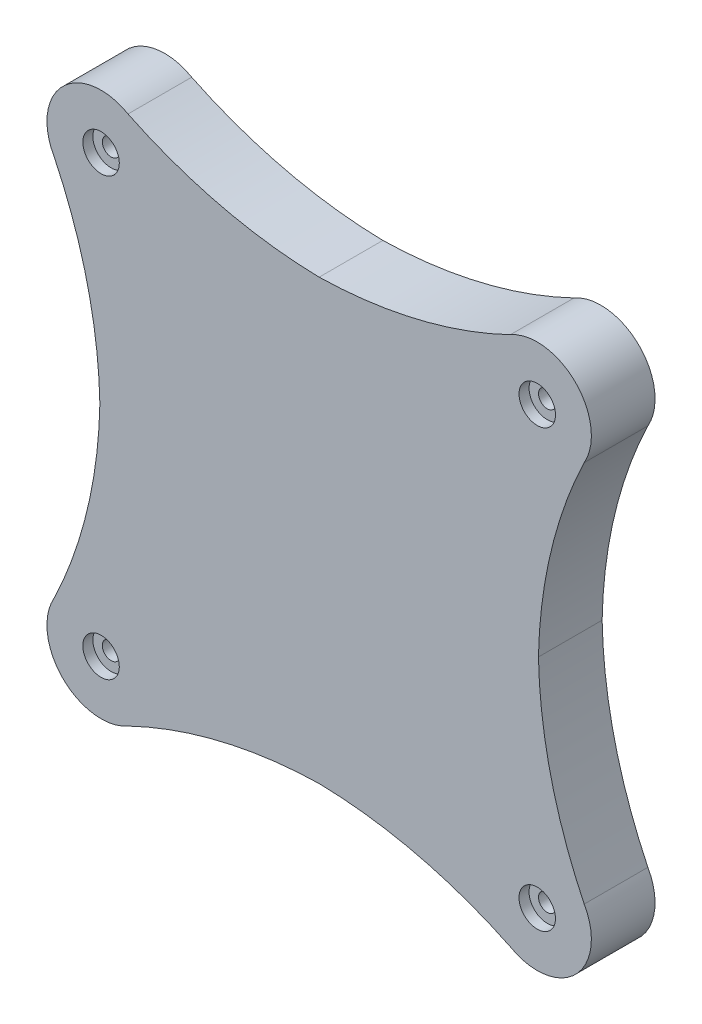
ISO-10303-21;
HEADER;
FILE_DESCRIPTION(('STEP AP214'),'2;1');
FILE_NAME('part.step','',(''),(''),'','','');
FILE_SCHEMA(('AUTOMOTIVE_DESIGN { 1 0 10303 214 1 1 1 1 }'));
ENDSEC;
DATA;
#1=APPLICATION_CONTEXT('core data for automotive mechanical design processes');
#2=APPLICATION_PROTOCOL_DEFINITION('international standard','automotive_design',2000,#1);
#3=PRODUCT_CONTEXT('',#1,'mechanical');
#4=PRODUCT('Part','Part','',(#3));
#5=PRODUCT_RELATED_PRODUCT_CATEGORY('part','',(#4));
#6=PRODUCT_DEFINITION_FORMATION('','',#4);
#7=PRODUCT_DEFINITION_CONTEXT('part definition',#1,'design');
#8=PRODUCT_DEFINITION('design','',#6,#7);
#9=PRODUCT_DEFINITION_SHAPE('','',#8);
#10=(LENGTH_UNIT() NAMED_UNIT(*) SI_UNIT(.MILLI.,.METRE.));
#11=(NAMED_UNIT(*) PLANE_ANGLE_UNIT() SI_UNIT($,.RADIAN.));
#12=(NAMED_UNIT(*) SI_UNIT($,.STERADIAN.) SOLID_ANGLE_UNIT());
#13=UNCERTAINTY_MEASURE_WITH_UNIT(LENGTH_MEASURE(1.E-05),#10,'distance_accuracy_value','');
#14=(GEOMETRIC_REPRESENTATION_CONTEXT(3) GLOBAL_UNCERTAINTY_ASSIGNED_CONTEXT((#13)) GLOBAL_UNIT_ASSIGNED_CONTEXT((#10,
#11,#12)) REPRESENTATION_CONTEXT('',''));
#15=CARTESIAN_POINT('',(0.,0.,0.));
#16=DIRECTION('',(0.,0.,1.));
#17=DIRECTION('',(1.,0.,0.));
#18=AXIS2_PLACEMENT_3D('',#15,#16,#17);
#19=CARTESIAN_POINT('',(0.,0.,0.));
#20=DIRECTION('',(0.,0.,1.));
#21=DIRECTION('',(1.,0.,0.));
#22=AXIS2_PLACEMENT_3D('',#19,#20,#21);
#23=PLANE('',#22);
#24=CARTESIAN_POINT('',(-86.9962311728574,86.9962311728574,0.));
#25=DIRECTION('',(0.,0.,1.));
#26=DIRECTION('',(1.,0.,0.));
#27=AXIS2_PLACEMENT_3D('',#24,#25,#26);
#28=CIRCLE('',#27,3.50000000000004);
#29=CARTESIAN_POINT('',(-83.4962311728574,86.9962311728574,0.));
#30=VERTEX_POINT('',#29);
#31=EDGE_CURVE('E282',#30,#30,#28,.T.);
#32=ORIENTED_EDGE('',*,*,#31,.T.);
#33=EDGE_LOOP('',(#32));
#34=FACE_BOUND('',#33,.T.);
#35=CARTESIAN_POINT('',(86.9962311728574,86.9962311728574,0.));
#36=DIRECTION('',(0.,0.,1.));
#37=DIRECTION('',(1.,0.,0.));
#38=AXIS2_PLACEMENT_3D('',#35,#36,#37);
#39=CIRCLE('',#38,3.50000000000004);
#40=CARTESIAN_POINT('',(90.4962311728575,86.9962311728574,0.));
#41=VERTEX_POINT('',#40);
#42=EDGE_CURVE('E286',#41,#41,#39,.T.);
#43=ORIENTED_EDGE('',*,*,#42,.T.);
#44=EDGE_LOOP('',(#43));
#45=FACE_BOUND('',#44,.T.);
#46=CARTESIAN_POINT('',(86.9962311728574,-86.9962311728574,0.));
#47=DIRECTION('',(0.,0.,1.));
#48=DIRECTION('',(1.,0.,0.));
#49=AXIS2_PLACEMENT_3D('',#46,#47,#48);
#50=CIRCLE('',#49,3.50000000000004);
#51=CARTESIAN_POINT('',(90.4962311728575,-86.9962311728574,0.));
#52=VERTEX_POINT('',#51);
#53=EDGE_CURVE('E290',#52,#52,#50,.T.);
#54=ORIENTED_EDGE('',*,*,#53,.T.);
#55=EDGE_LOOP('',(#54));
#56=FACE_BOUND('',#55,.T.);
#57=CARTESIAN_POINT('',(-86.9962311728574,-86.9962311728574,0.));
#58=DIRECTION('',(0.,0.,1.));
#59=DIRECTION('',(1.,0.,0.));
#60=AXIS2_PLACEMENT_3D('',#57,#58,#59);
#61=CIRCLE('',#60,3.50000000000004);
#62=CARTESIAN_POINT('',(-83.4962311728574,-86.9962311728574,0.));
#63=VERTEX_POINT('',#62);
#64=EDGE_CURVE('E230',#63,#63,#61,.T.);
#65=ORIENTED_EDGE('',*,*,#64,.T.);
#66=EDGE_LOOP('',(#65));
#67=FACE_BOUND('',#66,.T.);
#68=CARTESIAN_POINT('',(0.,0.,0.));
#69=DIRECTION('',(0.,0.,1.));
#70=DIRECTION('',(1.,0.,0.));
#71=AXIS2_PLACEMENT_3D('',#68,#69,#70);
#72=CIRCLE('',#71,72.38365);
#73=CARTESIAN_POINT('',(72.38365,0.,0.));
#74=VERTEX_POINT('',#73);
#75=EDGE_CURVE('E223',#74,#74,#72,.F.);
#76=ORIENTED_EDGE('',*,*,#75,.F.);
#77=EDGE_LOOP('',(#76));
#78=FACE_BOUND('',#77,.T.);
#79=CARTESIAN_POINT('',(3.75743542659805,271.582912256944,0.));
#80=DIRECTION('',(0.,0.,-1.));
#81=DIRECTION('',(1.,0.,0.));
#82=AXIS2_PLACEMENT_3D('',#79,#80,#81);
#83=CIRCLE('',#82,184.15);
#84=CARTESIAN_POINT('',(1.309065703059E-12,87.47125,0.));
#85=VERTEX_POINT('',#84);
#86=CARTESIAN_POINT('',(-76.2460057365222,105.719498864902,0.));
#87=VERTEX_POINT('',#86);
#88=EDGE_CURVE('E198',#85,#87,#83,.T.);
#89=ORIENTED_EDGE('',*,*,#88,.F.);
#90=CARTESIAN_POINT('',(-3.75743542659805,271.582912256944,0.));
#91=DIRECTION('',(0.,0.,-1.));
#92=DIRECTION('',(-1.,0.,0.));
#93=AXIS2_PLACEMENT_3D('',#90,#91,#92);
#94=CIRCLE('',#93,184.15);
#95=CARTESIAN_POINT('',(76.2460057365222,105.719498864903,0.));
#96=VERTEX_POINT('',#95);
#97=EDGE_CURVE('E195',#96,#85,#94,.T.);
#98=ORIENTED_EDGE('',*,*,#97,.F.);
#99=CARTESIAN_POINT('',(86.9962311728574,86.9962311728574,0.));
#100=DIRECTION('',(0.,0.,1.));
#101=DIRECTION('',(-1.,0.,0.));
#102=AXIS2_PLACEMENT_3D('',#99,#100,#101);
#103=CIRCLE('',#102,21.5900000000001);
#104=CARTESIAN_POINT('',(105.719498864904,76.2460057365257,0.));
#105=VERTEX_POINT('',#104);
#106=EDGE_CURVE('E192',#105,#96,#103,.T.);
#107=ORIENTED_EDGE('',*,*,#106,.F.);
#108=CARTESIAN_POINT('',(271.582912256946,-3.75743542659512,0.));
#109=DIRECTION('',(0.,0.,-1.));
#110=DIRECTION('',(1.,0.,0.));
#111=AXIS2_PLACEMENT_3D('',#108,#109,#110);
#112=CIRCLE('',#111,184.150000000001);
#113=CARTESIAN_POINT('',(87.4712500000007,0.,0.));
#114=VERTEX_POINT('',#113);
#115=EDGE_CURVE('E189',#114,#105,#112,.T.);
#116=ORIENTED_EDGE('',*,*,#115,.F.);
#117=CARTESIAN_POINT('',(271.582912256946,3.75743542659512,0.));
#118=DIRECTION('',(0.,0.,-1.));
#119=DIRECTION('',(-1.,0.,0.));
#120=AXIS2_PLACEMENT_3D('',#117,#118,#119);
#121=CIRCLE('',#120,184.150000000001);
#122=CARTESIAN_POINT('',(105.719498864904,-76.2460057365262,0.));
#123=VERTEX_POINT('',#122);
#124=EDGE_CURVE('E186',#123,#114,#121,.T.);
#125=ORIENTED_EDGE('',*,*,#124,.F.);
#126=CARTESIAN_POINT('',(86.9962311728574,-86.9962311728574,0.));
#127=DIRECTION('',(0.,0.,1.));
#128=DIRECTION('',(1.,0.,0.));
#129=AXIS2_PLACEMENT_3D('',#126,#127,#128);
#130=CIRCLE('',#129,21.5900000000001);
#131=CARTESIAN_POINT('',(76.2460057365222,-105.719498864902,0.));
#132=VERTEX_POINT('',#131);
#133=EDGE_CURVE('E183',#132,#123,#130,.T.);
#134=ORIENTED_EDGE('',*,*,#133,.F.);
#135=CARTESIAN_POINT('',(-3.75743542659805,-271.582912256944,0.));
#136=DIRECTION('',(0.,0.,-1.));
#137=DIRECTION('',(1.,0.,0.));
#138=AXIS2_PLACEMENT_3D('',#135,#136,#137);
#139=CIRCLE('',#138,184.15);
#140=CARTESIAN_POINT('',(-1.309065703059E-12,-87.47125,0.));
#141=VERTEX_POINT('',#140);
#142=EDGE_CURVE('E180',#141,#132,#139,.T.);
#143=ORIENTED_EDGE('',*,*,#142,.F.);
#144=CARTESIAN_POINT('',(3.75743542659805,-271.582912256944,0.));
#145=DIRECTION('',(0.,0.,-1.));
#146=DIRECTION('',(-1.,0.,0.));
#147=AXIS2_PLACEMENT_3D('',#144,#145,#146);
#148=CIRCLE('',#147,184.15);
#149=CARTESIAN_POINT('',(-76.2460057365221,-105.719498864903,0.));
#150=VERTEX_POINT('',#149);
#151=EDGE_CURVE('E178',#150,#141,#148,.T.);
#152=ORIENTED_EDGE('',*,*,#151,.F.);
#153=CARTESIAN_POINT('',(-86.9962311728574,-86.9962311728574,0.));
#154=DIRECTION('',(0.,0.,1.));
#155=DIRECTION('',(-1.,0.,0.));
#156=AXIS2_PLACEMENT_3D('',#153,#154,#155);
#157=CIRCLE('',#156,21.5900000000001);
#158=CARTESIAN_POINT('',(-105.719498864904,-76.2460057365257,0.));
#159=VERTEX_POINT('',#158);
#160=EDGE_CURVE('E174',#159,#150,#157,.T.);
#161=ORIENTED_EDGE('',*,*,#160,.F.);
#162=CARTESIAN_POINT('',(-271.582912256946,3.75743542659512,0.));
#163=DIRECTION('',(0.,0.,-1.));
#164=DIRECTION('',(1.,0.,0.));
#165=AXIS2_PLACEMENT_3D('',#162,#163,#164);
#166=CIRCLE('',#165,184.150000000001);
#167=CARTESIAN_POINT('',(-87.47125,-3.54855034245816E-11,0.));
#168=VERTEX_POINT('',#167);
#169=EDGE_CURVE('E175',#168,#159,#166,.T.);
#170=ORIENTED_EDGE('',*,*,#169,.F.);
#171=CARTESIAN_POINT('',(-271.582912256946,-3.75743542659512,0.));
#172=DIRECTION('',(0.,0.,-1.));
#173=DIRECTION('',(-1.,0.,0.));
#174=AXIS2_PLACEMENT_3D('',#171,#172,#173);
#175=CIRCLE('',#174,184.150000000001);
#176=CARTESIAN_POINT('',(-105.719498864904,76.2460057365261,0.));
#177=VERTEX_POINT('',#176);
#178=EDGE_CURVE('E136',#177,#168,#175,.T.);
#179=ORIENTED_EDGE('',*,*,#178,.F.);
#180=CARTESIAN_POINT('',(-86.9962311728574,86.9962311728574,0.));
#181=DIRECTION('',(0.,0.,1.));
#182=DIRECTION('',(1.,0.,0.));
#183=AXIS2_PLACEMENT_3D('',#180,#181,#182);
#184=CIRCLE('',#183,21.5900000000001);
#185=EDGE_CURVE('E132',#87,#177,#184,.T.);
#186=ORIENTED_EDGE('',*,*,#185,.F.);
#187=EDGE_LOOP('',(#89,#98,#107,#116,#125,#134,#143,#152,#161,#170,#179,#186));
#188=FACE_BOUND('',#187,.T.);
#189=ADVANCED_FACE('F36',(#34,#45,#56,#67,#78,#188),#23,.F.);
#190=CARTESIAN_POINT('',(-271.582912256946,3.75743542659512,332.528241623271));
#191=DIRECTION('',(0.,0.,-1.));
#192=DIRECTION('',(-1.,0.,0.));
#193=AXIS2_PLACEMENT_3D('',#190,#191,#192);
#194=CYLINDRICAL_SURFACE('',#193,184.150000000001);
#195=CARTESIAN_POINT('',(-271.582912256946,3.75743542659512,25.4));
#196=DIRECTION('',(0.,0.,1.));
#197=DIRECTION('',(1.,0.,0.));
#198=AXIS2_PLACEMENT_3D('',#195,#196,#197);
#199=CIRCLE('',#198,184.150000000001);
#200=CARTESIAN_POINT('',(-87.4712500000007,0.,25.4));
#201=VERTEX_POINT('',#200);
#202=CARTESIAN_POINT('',(-105.719498864904,-76.2460057365257,25.4));
#203=VERTEX_POINT('',#202);
#204=EDGE_CURVE('E142',#201,#203,#199,.F.);
#205=ORIENTED_EDGE('',*,*,#204,.F.);
#206=DIRECTION('',(0.,0.,-1.));
#207=VECTOR('',#206,1.);
#208=CARTESIAN_POINT('',(-87.4712500000007,0.,332.528241623271));
#209=LINE('',#208,#207);
#210=EDGE_CURVE('E39',#201,#168,#209,.T.);
#211=ORIENTED_EDGE('',*,*,#210,.T.);
#212=ORIENTED_EDGE('',*,*,#169,.T.);
#213=DIRECTION('',(0.,0.,-1.));
#214=VECTOR('',#213,1.);
#215=CARTESIAN_POINT('',(-105.719498864904,-76.2460057365257,332.528241623271));
#216=LINE('',#215,#214);
#217=EDGE_CURVE('E172',#203,#159,#216,.T.);
#218=ORIENTED_EDGE('',*,*,#217,.F.);
#219=EDGE_LOOP('',(#205,#211,#212,#218));
#220=FACE_BOUND('',#219,.T.);
#221=ADVANCED_FACE('F240',(#220),#194,.F.);
#222=CARTESIAN_POINT('',(-86.9962311728574,-86.9962311728574,332.528241623271));
#223=DIRECTION('',(0.,0.,-1.));
#224=DIRECTION('',(-1.,0.,0.));
#225=AXIS2_PLACEMENT_3D('',#222,#223,#224);
#226=CYLINDRICAL_SURFACE('',#225,21.5900000000001);
#227=CARTESIAN_POINT('',(-86.9962311728574,-86.9962311728574,25.4));
#228=DIRECTION('',(0.,0.,1.));
#229=DIRECTION('',(1.,0.,0.));
#230=AXIS2_PLACEMENT_3D('',#227,#228,#229);
#231=CIRCLE('',#230,21.5900000000001);
#232=CARTESIAN_POINT('',(-76.2460057365221,-105.719498864903,25.4));
#233=VERTEX_POINT('',#232);
#234=EDGE_CURVE('E168',#203,#233,#231,.T.);
#235=ORIENTED_EDGE('',*,*,#234,.F.);
#236=ORIENTED_EDGE('',*,*,#217,.T.);
#237=ORIENTED_EDGE('',*,*,#160,.T.);
#238=DIRECTION('',(0.,0.,-1.));
#239=VECTOR('',#238,1.);
#240=CARTESIAN_POINT('',(-76.2460057365221,-105.719498864903,332.528241623271));
#241=LINE('',#240,#239);
#242=EDGE_CURVE('E176',#233,#150,#241,.T.);
#243=ORIENTED_EDGE('',*,*,#242,.F.);
#244=EDGE_LOOP('',(#235,#236,#237,#243));
#245=FACE_BOUND('',#244,.T.);
#246=ADVANCED_FACE('F239',(#245),#226,.T.);
#247=CARTESIAN_POINT('',(3.75743542659805,-271.582912256944,332.528241623271));
#248=DIRECTION('',(0.,0.,-1.));
#249=DIRECTION('',(-1.,0.,0.));
#250=AXIS2_PLACEMENT_3D('',#247,#248,#249);
#251=CYLINDRICAL_SURFACE('',#250,184.15);
#252=CARTESIAN_POINT('',(3.75743542659805,-271.582912256944,25.4));
#253=DIRECTION('',(0.,0.,1.));
#254=DIRECTION('',(1.,0.,0.));
#255=AXIS2_PLACEMENT_3D('',#252,#253,#254);
#256=CIRCLE('',#255,184.15);
#257=CARTESIAN_POINT('',(0.,-87.47125,25.4));
#258=VERTEX_POINT('',#257);
#259=EDGE_CURVE('E165',#233,#258,#256,.F.);
#260=ORIENTED_EDGE('',*,*,#259,.F.);
#261=ORIENTED_EDGE('',*,*,#242,.T.);
#262=ORIENTED_EDGE('',*,*,#151,.T.);
#263=DIRECTION('',(0.,0.,-1.));
#264=VECTOR('',#263,1.);
#265=CARTESIAN_POINT('',(0.,-87.47125,332.528241623271));
#266=LINE('',#265,#264);
#267=EDGE_CURVE('E60',#258,#141,#266,.T.);
#268=ORIENTED_EDGE('',*,*,#267,.F.);
#269=EDGE_LOOP('',(#260,#261,#262,#268));
#270=FACE_BOUND('',#269,.T.);
#271=ADVANCED_FACE('F242',(#270),#251,.F.);
#272=CARTESIAN_POINT('',(-3.75743542659805,-271.582912256944,332.528241623271));
#273=DIRECTION('',(0.,0.,-1.));
#274=DIRECTION('',(-1.,0.,0.));
#275=AXIS2_PLACEMENT_3D('',#272,#273,#274);
#276=CYLINDRICAL_SURFACE('',#275,184.15);
#277=CARTESIAN_POINT('',(-3.75743542659805,-271.582912256944,25.4));
#278=DIRECTION('',(0.,0.,1.));
#279=DIRECTION('',(1.,0.,0.));
#280=AXIS2_PLACEMENT_3D('',#277,#278,#279);
#281=CIRCLE('',#280,184.15);
#282=CARTESIAN_POINT('',(76.2460057365222,-105.719498864902,25.4));
#283=VERTEX_POINT('',#282);
#284=EDGE_CURVE('E162',#258,#283,#281,.F.);
#285=ORIENTED_EDGE('',*,*,#284,.F.);
#286=ORIENTED_EDGE('',*,*,#267,.T.);
#287=ORIENTED_EDGE('',*,*,#142,.T.);
#288=DIRECTION('',(0.,0.,-1.));
#289=VECTOR('',#288,1.);
#290=CARTESIAN_POINT('',(76.2460057365222,-105.719498864902,332.528241623271));
#291=LINE('',#290,#289);
#292=EDGE_CURVE('E181',#283,#132,#291,.T.);
#293=ORIENTED_EDGE('',*,*,#292,.F.);
#294=EDGE_LOOP('',(#285,#286,#287,#293));
#295=FACE_BOUND('',#294,.T.);
#296=ADVANCED_FACE('F246',(#295),#276,.F.);
#297=CARTESIAN_POINT('',(86.9962311728574,-86.9962311728574,332.528241623271));
#298=DIRECTION('',(0.,0.,-1.));
#299=DIRECTION('',(-1.,0.,0.));
#300=AXIS2_PLACEMENT_3D('',#297,#298,#299);
#301=CYLINDRICAL_SURFACE('',#300,21.5900000000001);
#302=CARTESIAN_POINT('',(86.9962311728574,-86.9962311728574,25.4));
#303=DIRECTION('',(0.,0.,1.));
#304=DIRECTION('',(1.,0.,0.));
#305=AXIS2_PLACEMENT_3D('',#302,#303,#304);
#306=CIRCLE('',#305,21.5900000000001);
#307=CARTESIAN_POINT('',(105.719498864904,-76.2460057365262,25.4));
#308=VERTEX_POINT('',#307);
#309=EDGE_CURVE('E160',#283,#308,#306,.T.);
#310=ORIENTED_EDGE('',*,*,#309,.F.);
#311=ORIENTED_EDGE('',*,*,#292,.T.);
#312=ORIENTED_EDGE('',*,*,#133,.T.);
#313=DIRECTION('',(0.,0.,-1.));
#314=VECTOR('',#313,1.);
#315=CARTESIAN_POINT('',(105.719498864904,-76.2460057365262,332.528241623271));
#316=LINE('',#315,#314);
#317=EDGE_CURVE('E184',#308,#123,#316,.T.);
#318=ORIENTED_EDGE('',*,*,#317,.F.);
#319=EDGE_LOOP('',(#310,#311,#312,#318));
#320=FACE_BOUND('',#319,.T.);
#321=ADVANCED_FACE('F248',(#320),#301,.T.);
#322=CARTESIAN_POINT('',(271.582912256946,3.75743542659512,332.528241623271));
#323=DIRECTION('',(0.,0.,-1.));
#324=DIRECTION('',(-1.,0.,0.));
#325=AXIS2_PLACEMENT_3D('',#322,#323,#324);
#326=CYLINDRICAL_SURFACE('',#325,184.150000000001);
#327=CARTESIAN_POINT('',(271.582912256946,3.75743542659512,25.4));
#328=DIRECTION('',(0.,0.,1.));
#329=DIRECTION('',(1.,0.,0.));
#330=AXIS2_PLACEMENT_3D('',#327,#328,#329);
#331=CIRCLE('',#330,184.150000000001);
#332=CARTESIAN_POINT('',(87.47125,-3.54855034245816E-11,25.4));
#333=VERTEX_POINT('',#332);
#334=EDGE_CURVE('E52',#308,#333,#331,.F.);
#335=ORIENTED_EDGE('',*,*,#334,.F.);
#336=ORIENTED_EDGE('',*,*,#317,.T.);
#337=ORIENTED_EDGE('',*,*,#124,.T.);
#338=DIRECTION('',(0.,0.,-1.));
#339=VECTOR('',#338,1.);
#340=CARTESIAN_POINT('',(87.4712500000007,0.,332.528241623271));
#341=LINE('',#340,#339);
#342=EDGE_CURVE('E187',#333,#114,#341,.T.);
#343=ORIENTED_EDGE('',*,*,#342,.F.);
#344=EDGE_LOOP('',(#335,#336,#337,#343));
#345=FACE_BOUND('',#344,.T.);
#346=ADVANCED_FACE('F251',(#345),#326,.F.);
#347=CARTESIAN_POINT('',(271.582912256946,-3.75743542659512,332.528241623271));
#348=DIRECTION('',(0.,0.,-1.));
#349=DIRECTION('',(-1.,0.,0.));
#350=AXIS2_PLACEMENT_3D('',#347,#348,#349);
#351=CYLINDRICAL_SURFACE('',#350,184.150000000001);
#352=CARTESIAN_POINT('',(271.582912256946,-3.75743542659512,25.4));
#353=DIRECTION('',(0.,0.,1.));
#354=DIRECTION('',(1.,0.,0.));
#355=AXIS2_PLACEMENT_3D('',#352,#353,#354);
#356=CIRCLE('',#355,184.150000000001);
#357=CARTESIAN_POINT('',(105.719498864904,76.2460057365257,25.4));
#358=VERTEX_POINT('',#357);
#359=EDGE_CURVE('E157',#333,#358,#356,.F.);
#360=ORIENTED_EDGE('',*,*,#359,.F.);
#361=ORIENTED_EDGE('',*,*,#342,.T.);
#362=ORIENTED_EDGE('',*,*,#115,.T.);
#363=DIRECTION('',(0.,0.,-1.));
#364=VECTOR('',#363,1.);
#365=CARTESIAN_POINT('',(105.719498864904,76.2460057365257,332.528241623271));
#366=LINE('',#365,#364);
#367=EDGE_CURVE('E190',#358,#105,#366,.T.);
#368=ORIENTED_EDGE('',*,*,#367,.F.);
#369=EDGE_LOOP('',(#360,#361,#362,#368));
#370=FACE_BOUND('',#369,.T.);
#371=ADVANCED_FACE('F256',(#370),#351,.F.);
#372=CARTESIAN_POINT('',(86.9962311728574,86.9962311728574,332.528241623271));
#373=DIRECTION('',(0.,0.,-1.));
#374=DIRECTION('',(-1.,0.,0.));
#375=AXIS2_PLACEMENT_3D('',#372,#373,#374);
#376=CYLINDRICAL_SURFACE('',#375,21.5900000000001);
#377=CARTESIAN_POINT('',(86.9962311728574,86.9962311728574,25.4));
#378=DIRECTION('',(0.,0.,1.));
#379=DIRECTION('',(1.,0.,0.));
#380=AXIS2_PLACEMENT_3D('',#377,#378,#379);
#381=CIRCLE('',#380,21.5900000000001);
#382=CARTESIAN_POINT('',(76.2460057365222,105.719498864903,25.4));
#383=VERTEX_POINT('',#382);
#384=EDGE_CURVE('E152',#358,#383,#381,.T.);
#385=ORIENTED_EDGE('',*,*,#384,.F.);
#386=ORIENTED_EDGE('',*,*,#367,.T.);
#387=ORIENTED_EDGE('',*,*,#106,.T.);
#388=DIRECTION('',(0.,0.,-1.));
#389=VECTOR('',#388,1.);
#390=CARTESIAN_POINT('',(76.2460057365222,105.719498864903,332.528241623271));
#391=LINE('',#390,#389);
#392=EDGE_CURVE('E193',#383,#96,#391,.T.);
#393=ORIENTED_EDGE('',*,*,#392,.F.);
#394=EDGE_LOOP('',(#385,#386,#387,#393));
#395=FACE_BOUND('',#394,.T.);
#396=ADVANCED_FACE('F259',(#395),#376,.T.);
#397=CARTESIAN_POINT('',(-3.75743542659805,271.582912256944,332.528241623271));
#398=DIRECTION('',(0.,0.,-1.));
#399=DIRECTION('',(-1.,0.,0.));
#400=AXIS2_PLACEMENT_3D('',#397,#398,#399);
#401=CYLINDRICAL_SURFACE('',#400,184.15);
#402=CARTESIAN_POINT('',(-3.75743542659805,271.582912256944,25.4));
#403=DIRECTION('',(0.,0.,1.));
#404=DIRECTION('',(1.,0.,0.));
#405=AXIS2_PLACEMENT_3D('',#402,#403,#404);
#406=CIRCLE('',#405,184.15);
#407=CARTESIAN_POINT('',(0.,87.47125,25.4));
#408=VERTEX_POINT('',#407);
#409=EDGE_CURVE('E148',#383,#408,#406,.F.);
#410=ORIENTED_EDGE('',*,*,#409,.F.);
#411=ORIENTED_EDGE('',*,*,#392,.T.);
#412=ORIENTED_EDGE('',*,*,#97,.T.);
#413=DIRECTION('',(0.,0.,-1.));
#414=VECTOR('',#413,1.);
#415=CARTESIAN_POINT('',(0.,87.47125,332.528241623271));
#416=LINE('',#415,#414);
#417=EDGE_CURVE('E196',#408,#85,#416,.T.);
#418=ORIENTED_EDGE('',*,*,#417,.F.);
#419=EDGE_LOOP('',(#410,#411,#412,#418));
#420=FACE_BOUND('',#419,.T.);
#421=ADVANCED_FACE('F263',(#420),#401,.F.);
#422=CARTESIAN_POINT('',(3.75743542659805,271.582912256944,332.528241623271));
#423=DIRECTION('',(0.,0.,-1.));
#424=DIRECTION('',(-1.,0.,0.));
#425=AXIS2_PLACEMENT_3D('',#422,#423,#424);
#426=CYLINDRICAL_SURFACE('',#425,184.15);
#427=CARTESIAN_POINT('',(3.75743542659805,271.582912256944,25.4));
#428=DIRECTION('',(0.,0.,1.));
#429=DIRECTION('',(1.,0.,0.));
#430=AXIS2_PLACEMENT_3D('',#427,#428,#429);
#431=CIRCLE('',#430,184.15);
#432=CARTESIAN_POINT('',(-76.2460057365222,105.719498864902,25.4));
#433=VERTEX_POINT('',#432);
#434=EDGE_CURVE('E44',#408,#433,#431,.F.);
#435=ORIENTED_EDGE('',*,*,#434,.F.);
#436=ORIENTED_EDGE('',*,*,#417,.T.);
#437=ORIENTED_EDGE('',*,*,#88,.T.);
#438=DIRECTION('',(0.,0.,-1.));
#439=VECTOR('',#438,1.);
#440=CARTESIAN_POINT('',(-76.2460057365222,105.719498864902,332.528241623271));
#441=LINE('',#440,#439);
#442=EDGE_CURVE('E199',#433,#87,#441,.T.);
#443=ORIENTED_EDGE('',*,*,#442,.F.);
#444=EDGE_LOOP('',(#435,#436,#437,#443));
#445=FACE_BOUND('',#444,.T.);
#446=ADVANCED_FACE('F264',(#445),#426,.F.);
#447=CARTESIAN_POINT('',(-86.9962311728574,86.9962311728574,332.528241623271));
#448=DIRECTION('',(0.,0.,-1.));
#449=DIRECTION('',(-1.,0.,0.));
#450=AXIS2_PLACEMENT_3D('',#447,#448,#449);
#451=CYLINDRICAL_SURFACE('',#450,21.5900000000001);
#452=CARTESIAN_POINT('',(-86.9962311728574,86.9962311728574,25.4));
#453=DIRECTION('',(0.,0.,1.));
#454=DIRECTION('',(1.,0.,0.));
#455=AXIS2_PLACEMENT_3D('',#452,#453,#454);
#456=CIRCLE('',#455,21.5900000000001);
#457=CARTESIAN_POINT('',(-105.719498864904,76.2460057365261,25.4));
#458=VERTEX_POINT('',#457);
#459=EDGE_CURVE('E11',#433,#458,#456,.T.);
#460=ORIENTED_EDGE('',*,*,#459,.F.);
#461=ORIENTED_EDGE('',*,*,#442,.T.);
#462=ORIENTED_EDGE('',*,*,#185,.T.);
#463=DIRECTION('',(0.,0.,-1.));
#464=VECTOR('',#463,1.);
#465=CARTESIAN_POINT('',(-105.719498864904,76.2460057365261,332.528241623271));
#466=LINE('',#465,#464);
#467=EDGE_CURVE('E127',#458,#177,#466,.T.);
#468=ORIENTED_EDGE('',*,*,#467,.F.);
#469=EDGE_LOOP('',(#460,#461,#462,#468));
#470=FACE_BOUND('',#469,.T.);
#471=ADVANCED_FACE('F129',(#470),#451,.T.);
#472=CARTESIAN_POINT('',(-271.582912256946,-3.75743542659512,332.528241623271));
#473=DIRECTION('',(0.,0.,-1.));
#474=DIRECTION('',(-1.,0.,0.));
#475=AXIS2_PLACEMENT_3D('',#472,#473,#474);
#476=CYLINDRICAL_SURFACE('',#475,184.150000000001);
#477=CARTESIAN_POINT('',(-271.582912256946,-3.75743542659512,25.4));
#478=DIRECTION('',(0.,0.,1.));
#479=DIRECTION('',(1.,0.,0.));
#480=AXIS2_PLACEMENT_3D('',#477,#478,#479);
#481=CIRCLE('',#480,184.150000000001);
#482=EDGE_CURVE('E138',#458,#201,#481,.F.);
#483=ORIENTED_EDGE('',*,*,#482,.F.);
#484=ORIENTED_EDGE('',*,*,#467,.T.);
#485=ORIENTED_EDGE('',*,*,#178,.T.);
#486=ORIENTED_EDGE('',*,*,#210,.F.);
#487=EDGE_LOOP('',(#483,#484,#485,#486));
#488=FACE_BOUND('',#487,.T.);
#489=ADVANCED_FACE('F139',(#488),#476,.F.);
#490=CARTESIAN_POINT('',(0.,0.,25.4));
#491=DIRECTION('',(0.,0.,1.));
#492=DIRECTION('',(1.,0.,0.));
#493=AXIS2_PLACEMENT_3D('',#490,#491,#492);
#494=PLANE('',#493);
#495=CARTESIAN_POINT('',(-86.9962311728574,86.9962311728574,25.4));
#496=DIRECTION('',(0.,0.,1.));
#497=DIRECTION('',(1.,0.,0.));
#498=AXIS2_PLACEMENT_3D('',#495,#496,#497);
#499=CIRCLE('',#498,7.2735);
#500=CARTESIAN_POINT('',(-79.7227311728574,86.9962311728574,25.4));
#501=VERTEX_POINT('',#500);
#502=EDGE_CURVE('E332',#501,#501,#499,.T.);
#503=ORIENTED_EDGE('',*,*,#502,.F.);
#504=EDGE_LOOP('',(#503));
#505=FACE_BOUND('',#504,.T.);
#506=CARTESIAN_POINT('',(86.9962311728574,86.9962311728574,25.4));
#507=DIRECTION('',(0.,0.,1.));
#508=DIRECTION('',(1.,0.,0.));
#509=AXIS2_PLACEMENT_3D('',#506,#507,#508);
#510=CIRCLE('',#509,7.2735);
#511=CARTESIAN_POINT('',(94.2697311728574,86.9962311728574,25.4));
#512=VERTEX_POINT('',#511);
#513=EDGE_CURVE('E322',#512,#512,#510,.T.);
#514=ORIENTED_EDGE('',*,*,#513,.F.);
#515=EDGE_LOOP('',(#514));
#516=FACE_BOUND('',#515,.T.);
#517=CARTESIAN_POINT('',(86.9962311728574,-86.9962311728574,25.4));
#518=DIRECTION('',(0.,0.,1.));
#519=DIRECTION('',(1.,0.,0.));
#520=AXIS2_PLACEMENT_3D('',#517,#518,#519);
#521=CIRCLE('',#520,7.2735);
#522=CARTESIAN_POINT('',(94.2697311728574,-86.9962311728574,25.4));
#523=VERTEX_POINT('',#522);
#524=EDGE_CURVE('E312',#523,#523,#521,.T.);
#525=ORIENTED_EDGE('',*,*,#524,.F.);
#526=EDGE_LOOP('',(#525));
#527=FACE_BOUND('',#526,.T.);
#528=CARTESIAN_POINT('',(-86.9962311728574,-86.9962311728574,25.4));
#529=DIRECTION('',(0.,0.,1.));
#530=DIRECTION('',(1.,0.,0.));
#531=AXIS2_PLACEMENT_3D('',#528,#529,#530);
#532=CIRCLE('',#531,7.2735);
#533=CARTESIAN_POINT('',(-79.7227311728574,-86.9962311728574,25.4));
#534=VERTEX_POINT('',#533);
#535=EDGE_CURVE('E302',#534,#534,#532,.T.);
#536=ORIENTED_EDGE('',*,*,#535,.F.);
#537=EDGE_LOOP('',(#536));
#538=FACE_BOUND('',#537,.T.);
#539=ORIENTED_EDGE('',*,*,#334,.T.);
#540=ORIENTED_EDGE('',*,*,#359,.T.);
#541=ORIENTED_EDGE('',*,*,#384,.T.);
#542=ORIENTED_EDGE('',*,*,#409,.T.);
#543=ORIENTED_EDGE('',*,*,#434,.T.);
#544=ORIENTED_EDGE('',*,*,#459,.T.);
#545=ORIENTED_EDGE('',*,*,#482,.T.);
#546=ORIENTED_EDGE('',*,*,#204,.T.);
#547=ORIENTED_EDGE('',*,*,#234,.T.);
#548=ORIENTED_EDGE('',*,*,#259,.T.);
#549=ORIENTED_EDGE('',*,*,#284,.T.);
#550=ORIENTED_EDGE('',*,*,#309,.T.);
#551=EDGE_LOOP('',(#539,#540,#541,#542,#543,#544,#545,#546,#547,#548,#549,#550));
#552=FACE_BOUND('',#551,.T.);
#553=ADVANCED_FACE('F145',(#505,#516,#527,#538,#552),#494,.T.);
#554=CARTESIAN_POINT('',(0.,0.,-0.001000000000001));
#555=DIRECTION('',(0.,0.,1.));
#556=DIRECTION('',(1.,0.,0.));
#557=AXIS2_PLACEMENT_3D('',#554,#555,#556);
#558=CYLINDRICAL_SURFACE('',#557,72.38365);
#559=CARTESIAN_POINT('',(0.,0.,21.59));
#560=DIRECTION('',(0.,0.,1.));
#561=DIRECTION('',(1.,0.,0.));
#562=AXIS2_PLACEMENT_3D('',#559,#560,#561);
#563=CIRCLE('',#562,72.38365);
#564=CARTESIAN_POINT('',(72.38365,0.,21.59));
#565=VERTEX_POINT('',#564);
#566=EDGE_CURVE('E225',#565,#565,#563,.T.);
#567=ORIENTED_EDGE('',*,*,#566,.T.);
#568=EDGE_LOOP('',(#567));
#569=FACE_BOUND('',#568,.T.);
#570=ORIENTED_EDGE('',*,*,#75,.T.);
#571=EDGE_LOOP('',(#570));
#572=FACE_BOUND('',#571,.T.);
#573=ADVANCED_FACE('F340',(#569,#572),#558,.F.);
#574=CARTESIAN_POINT('',(0.,0.,21.59));
#575=DIRECTION('',(0.,0.,1.));
#576=DIRECTION('',(1.,0.,0.));
#577=AXIS2_PLACEMENT_3D('',#574,#575,#576);
#578=PLANE('',#577);
#579=ORIENTED_EDGE('',*,*,#566,.F.);
#580=EDGE_LOOP('',(#579));
#581=FACE_BOUND('',#580,.T.);
#582=ADVANCED_FACE('F368',(#581),#578,.F.);
#583=CARTESIAN_POINT('',(-86.9962311728574,-86.9962311728574,25.4));
#584=DIRECTION('',(0.,0.,1.));
#585=DIRECTION('',(1.,0.,0.));
#586=AXIS2_PLACEMENT_3D('',#583,#584,#585);
#587=CYLINDRICAL_SURFACE('',#586,3.50000000000004);
#588=ORIENTED_EDGE('',*,*,#64,.F.);
#589=EDGE_LOOP('',(#588));
#590=FACE_BOUND('',#589,.T.);
#591=CARTESIAN_POINT('',(-86.9962311728574,-86.9962311728574,21.4));
#592=DIRECTION('',(0.,0.,1.));
#593=DIRECTION('',(1.,0.,0.));
#594=AXIS2_PLACEMENT_3D('',#591,#592,#593);
#595=CIRCLE('',#594,3.50000000000004);
#596=CARTESIAN_POINT('',(-83.4962311728574,-86.9962311728574,21.4));
#597=VERTEX_POINT('',#596);
#598=EDGE_CURVE('E295',#597,#597,#595,.T.);
#599=ORIENTED_EDGE('',*,*,#598,.T.);
#600=EDGE_LOOP('',(#599));
#601=FACE_BOUND('',#600,.T.);
#602=ADVANCED_FACE('F360',(#590,#601),#587,.F.);
#603=CARTESIAN_POINT('',(-83.4962311728574,-86.9962311728574,21.4));
#604=DIRECTION('',(0.,0.,-1.));
#605=DIRECTION('',(-1.,0.,0.));
#606=AXIS2_PLACEMENT_3D('',#603,#604,#605);
#607=PLANE('',#606);
#608=ORIENTED_EDGE('',*,*,#598,.F.);
#609=EDGE_LOOP('',(#608));
#610=FACE_BOUND('',#609,.T.);
#611=CARTESIAN_POINT('',(-86.9962311728574,-86.9962311728574,21.4));
#612=DIRECTION('',(0.,0.,1.));
#613=DIRECTION('',(1.,0.,0.));
#614=AXIS2_PLACEMENT_3D('',#611,#612,#613);
#615=CIRCLE('',#614,7.2735);
#616=CARTESIAN_POINT('',(-79.7227311728574,-86.9962311728574,21.4));
#617=VERTEX_POINT('',#616);
#618=EDGE_CURVE('E297',#617,#617,#615,.T.);
#619=ORIENTED_EDGE('',*,*,#618,.T.);
#620=EDGE_LOOP('',(#619));
#621=FACE_BOUND('',#620,.T.);
#622=ADVANCED_FACE('F350',(#610,#621),#607,.F.);
#623=CARTESIAN_POINT('',(-86.9962311728574,-86.9962311728574,25.4));
#624=DIRECTION('',(0.,0.,1.));
#625=DIRECTION('',(1.,0.,0.));
#626=AXIS2_PLACEMENT_3D('',#623,#624,#625);
#627=CYLINDRICAL_SURFACE('',#626,7.2735);
#628=ORIENTED_EDGE('',*,*,#618,.F.);
#629=EDGE_LOOP('',(#628));
#630=FACE_BOUND('',#629,.T.);
#631=ORIENTED_EDGE('',*,*,#535,.T.);
#632=EDGE_LOOP('',(#631));
#633=FACE_BOUND('',#632,.T.);
#634=ADVANCED_FACE('F347',(#630,#633),#627,.F.);
#635=CARTESIAN_POINT('',(86.9962311728574,-86.9962311728574,25.4));
#636=DIRECTION('',(0.,0.,1.));
#637=DIRECTION('',(1.,0.,0.));
#638=AXIS2_PLACEMENT_3D('',#635,#636,#637);
#639=CYLINDRICAL_SURFACE('',#638,3.50000000000004);
#640=ORIENTED_EDGE('',*,*,#53,.F.);
#641=EDGE_LOOP('',(#640));
#642=FACE_BOUND('',#641,.T.);
#643=CARTESIAN_POINT('',(86.9962311728574,-86.9962311728574,21.4));
#644=DIRECTION('',(0.,0.,1.));
#645=DIRECTION('',(1.,0.,0.));
#646=AXIS2_PLACEMENT_3D('',#643,#644,#645);
#647=CIRCLE('',#646,3.50000000000004);
#648=CARTESIAN_POINT('',(90.4962311728575,-86.9962311728574,21.4));
#649=VERTEX_POINT('',#648);
#650=EDGE_CURVE('E306',#649,#649,#647,.T.);
#651=ORIENTED_EDGE('',*,*,#650,.T.);
#652=EDGE_LOOP('',(#651));
#653=FACE_BOUND('',#652,.T.);
#654=ADVANCED_FACE('F349',(#642,#653),#639,.F.);
#655=CARTESIAN_POINT('',(90.4962311728575,-86.9962311728574,21.4));
#656=DIRECTION('',(0.,0.,-1.));
#657=DIRECTION('',(-1.,0.,0.));
#658=AXIS2_PLACEMENT_3D('',#655,#656,#657);
#659=PLANE('',#658);
#660=ORIENTED_EDGE('',*,*,#650,.F.);
#661=EDGE_LOOP('',(#660));
#662=FACE_BOUND('',#661,.T.);
#663=CARTESIAN_POINT('',(86.9962311728574,-86.9962311728574,21.4));
#664=DIRECTION('',(0.,0.,1.));
#665=DIRECTION('',(1.,0.,0.));
#666=AXIS2_PLACEMENT_3D('',#663,#664,#665);
#667=CIRCLE('',#666,7.2735);
#668=CARTESIAN_POINT('',(94.2697311728574,-86.9962311728574,21.4));
#669=VERTEX_POINT('',#668);
#670=EDGE_CURVE('E309',#669,#669,#667,.T.);
#671=ORIENTED_EDGE('',*,*,#670,.T.);
#672=EDGE_LOOP('',(#671));
#673=FACE_BOUND('',#672,.T.);
#674=ADVANCED_FACE('F357',(#662,#673),#659,.F.);
#675=CARTESIAN_POINT('',(86.9962311728574,-86.9962311728574,25.4));
#676=DIRECTION('',(0.,0.,1.));
#677=DIRECTION('',(1.,0.,0.));
#678=AXIS2_PLACEMENT_3D('',#675,#676,#677);
#679=CYLINDRICAL_SURFACE('',#678,7.2735);
#680=ORIENTED_EDGE('',*,*,#670,.F.);
#681=EDGE_LOOP('',(#680));
#682=FACE_BOUND('',#681,.T.);
#683=ORIENTED_EDGE('',*,*,#524,.T.);
#684=EDGE_LOOP('',(#683));
#685=FACE_BOUND('',#684,.T.);
#686=ADVANCED_FACE('F419',(#682,#685),#679,.F.);
#687=CARTESIAN_POINT('',(86.9962311728574,86.9962311728574,25.4));
#688=DIRECTION('',(0.,0.,1.));
#689=DIRECTION('',(1.,0.,0.));
#690=AXIS2_PLACEMENT_3D('',#687,#688,#689);
#691=CYLINDRICAL_SURFACE('',#690,3.50000000000004);
#692=ORIENTED_EDGE('',*,*,#42,.F.);
#693=EDGE_LOOP('',(#692));
#694=FACE_BOUND('',#693,.T.);
#695=CARTESIAN_POINT('',(86.9962311728574,86.9962311728574,21.4));
#696=DIRECTION('',(0.,0.,1.));
#697=DIRECTION('',(1.,0.,0.));
#698=AXIS2_PLACEMENT_3D('',#695,#696,#697);
#699=CIRCLE('',#698,3.50000000000004);
#700=CARTESIAN_POINT('',(90.4962311728575,86.9962311728574,21.4));
#701=VERTEX_POINT('',#700);
#702=EDGE_CURVE('E316',#701,#701,#699,.T.);
#703=ORIENTED_EDGE('',*,*,#702,.T.);
#704=EDGE_LOOP('',(#703));
#705=FACE_BOUND('',#704,.T.);
#706=ADVANCED_FACE('F428',(#694,#705),#691,.F.);
#707=CARTESIAN_POINT('',(90.4962311728575,86.9962311728574,21.4));
#708=DIRECTION('',(0.,0.,-1.));
#709=DIRECTION('',(-1.,0.,0.));
#710=AXIS2_PLACEMENT_3D('',#707,#708,#709);
#711=PLANE('',#710);
#712=ORIENTED_EDGE('',*,*,#702,.F.);
#713=EDGE_LOOP('',(#712));
#714=FACE_BOUND('',#713,.T.);
#715=CARTESIAN_POINT('',(86.9962311728574,86.9962311728574,21.4));
#716=DIRECTION('',(0.,0.,1.));
#717=DIRECTION('',(1.,0.,0.));
#718=AXIS2_PLACEMENT_3D('',#715,#716,#717);
#719=CIRCLE('',#718,7.2735);
#720=CARTESIAN_POINT('',(94.2697311728574,86.9962311728574,21.4));
#721=VERTEX_POINT('',#720);
#722=EDGE_CURVE('E319',#721,#721,#719,.T.);
#723=ORIENTED_EDGE('',*,*,#722,.T.);
#724=EDGE_LOOP('',(#723));
#725=FACE_BOUND('',#724,.T.);
#726=ADVANCED_FACE('F438',(#714,#725),#711,.F.);
#727=CARTESIAN_POINT('',(86.9962311728574,86.9962311728574,25.4));
#728=DIRECTION('',(0.,0.,1.));
#729=DIRECTION('',(1.,0.,0.));
#730=AXIS2_PLACEMENT_3D('',#727,#728,#729);
#731=CYLINDRICAL_SURFACE('',#730,7.2735);
#732=ORIENTED_EDGE('',*,*,#722,.F.);
#733=EDGE_LOOP('',(#732));
#734=FACE_BOUND('',#733,.T.);
#735=ORIENTED_EDGE('',*,*,#513,.T.);
#736=EDGE_LOOP('',(#735));
#737=FACE_BOUND('',#736,.T.);
#738=ADVANCED_FACE('F448',(#734,#737),#731,.F.);
#739=CARTESIAN_POINT('',(-86.9962311728574,86.9962311728574,25.4));
#740=DIRECTION('',(0.,0.,1.));
#741=DIRECTION('',(1.,0.,0.));
#742=AXIS2_PLACEMENT_3D('',#739,#740,#741);
#743=CYLINDRICAL_SURFACE('',#742,3.50000000000004);
#744=ORIENTED_EDGE('',*,*,#31,.F.);
#745=EDGE_LOOP('',(#744));
#746=FACE_BOUND('',#745,.T.);
#747=CARTESIAN_POINT('',(-86.9962311728574,86.9962311728574,21.4));
#748=DIRECTION('',(0.,0.,1.));
#749=DIRECTION('',(1.,0.,0.));
#750=AXIS2_PLACEMENT_3D('',#747,#748,#749);
#751=CIRCLE('',#750,3.50000000000004);
#752=CARTESIAN_POINT('',(-83.4962311728574,86.9962311728574,21.4));
#753=VERTEX_POINT('',#752);
#754=EDGE_CURVE('E326',#753,#753,#751,.T.);
#755=ORIENTED_EDGE('',*,*,#754,.T.);
#756=EDGE_LOOP('',(#755));
#757=FACE_BOUND('',#756,.T.);
#758=ADVANCED_FACE('F458',(#746,#757),#743,.F.);
#759=CARTESIAN_POINT('',(-83.4962311728574,86.9962311728574,21.4));
#760=DIRECTION('',(0.,0.,-1.));
#761=DIRECTION('',(-1.,0.,0.));
#762=AXIS2_PLACEMENT_3D('',#759,#760,#761);
#763=PLANE('',#762);
#764=ORIENTED_EDGE('',*,*,#754,.F.);
#765=EDGE_LOOP('',(#764));
#766=FACE_BOUND('',#765,.T.);
#767=CARTESIAN_POINT('',(-86.9962311728574,86.9962311728574,21.4));
#768=DIRECTION('',(0.,0.,1.));
#769=DIRECTION('',(1.,0.,0.));
#770=AXIS2_PLACEMENT_3D('',#767,#768,#769);
#771=CIRCLE('',#770,7.2735);
#772=CARTESIAN_POINT('',(-79.7227311728574,86.9962311728574,21.4));
#773=VERTEX_POINT('',#772);
#774=EDGE_CURVE('E329',#773,#773,#771,.T.);
#775=ORIENTED_EDGE('',*,*,#774,.T.);
#776=EDGE_LOOP('',(#775));
#777=FACE_BOUND('',#776,.T.);
#778=ADVANCED_FACE('F468',(#766,#777),#763,.F.);
#779=CARTESIAN_POINT('',(-86.9962311728574,86.9962311728574,25.4));
#780=DIRECTION('',(0.,0.,1.));
#781=DIRECTION('',(1.,0.,0.));
#782=AXIS2_PLACEMENT_3D('',#779,#780,#781);
#783=CYLINDRICAL_SURFACE('',#782,7.2735);
#784=ORIENTED_EDGE('',*,*,#774,.F.);
#785=EDGE_LOOP('',(#784));
#786=FACE_BOUND('',#785,.T.);
#787=ORIENTED_EDGE('',*,*,#502,.T.);
#788=EDGE_LOOP('',(#787));
#789=FACE_BOUND('',#788,.T.);
#790=ADVANCED_FACE('F336',(#786,#789),#783,.F.);
#791=CLOSED_SHELL('',(#189,#221,#246,#271,#296,#321,#346,#371,#396,#421,#446,#471,#489,#553,
#573,#582,#602,#622,#634,#654,#674,#686,#706,#726,#738,#758,#778,#790));
#792=MANIFOLD_SOLID_BREP('B2',#791);
#793=ADVANCED_BREP_SHAPE_REPRESENTATION('',(#18,#792),#14);
#794=SHAPE_DEFINITION_REPRESENTATION(#9,#793);
ENDSEC;
END-ISO-10303-21;
